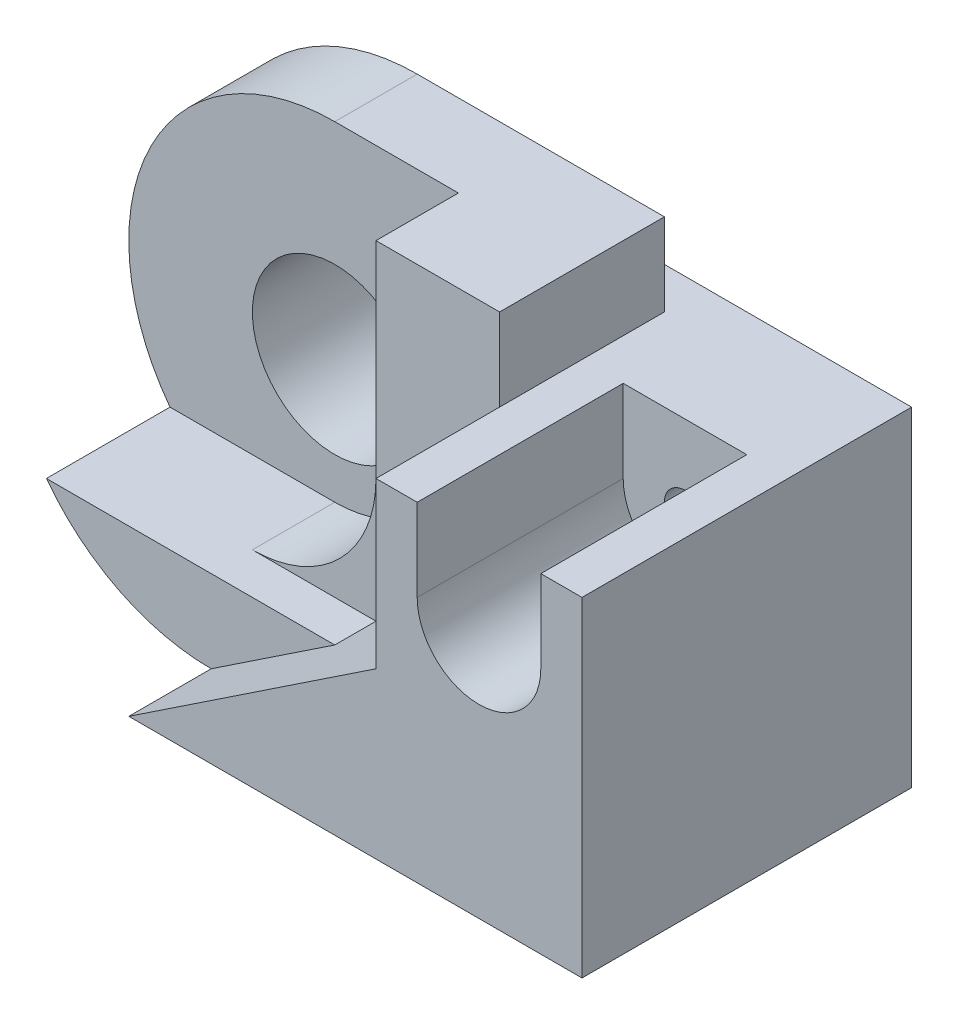
ISO-10303-21;
HEADER;
FILE_DESCRIPTION(('STEP AP214'),'2;1');
FILE_NAME('part.step','',(''),(''),'','','');
FILE_SCHEMA(('AUTOMOTIVE_DESIGN { 1 0 10303 214 1 1 1 1 }'));
ENDSEC;
DATA;
#1=APPLICATION_CONTEXT('core data for automotive mechanical design processes');
#2=APPLICATION_PROTOCOL_DEFINITION('international standard','automotive_design',2000,#1);
#3=PRODUCT_CONTEXT('',#1,'mechanical');
#4=PRODUCT('Part','Part','',(#3));
#5=PRODUCT_RELATED_PRODUCT_CATEGORY('part','',(#4));
#6=PRODUCT_DEFINITION_FORMATION('','',#4);
#7=PRODUCT_DEFINITION_CONTEXT('part definition',#1,'design');
#8=PRODUCT_DEFINITION('design','',#6,#7);
#9=PRODUCT_DEFINITION_SHAPE('','',#8);
#10=(LENGTH_UNIT() NAMED_UNIT(*) SI_UNIT(.MILLI.,.METRE.));
#11=(NAMED_UNIT(*) PLANE_ANGLE_UNIT() SI_UNIT($,.RADIAN.));
#12=(NAMED_UNIT(*) SI_UNIT($,.STERADIAN.) SOLID_ANGLE_UNIT());
#13=UNCERTAINTY_MEASURE_WITH_UNIT(LENGTH_MEASURE(1.E-05),#10,'distance_accuracy_value','');
#14=(GEOMETRIC_REPRESENTATION_CONTEXT(3) GLOBAL_UNCERTAINTY_ASSIGNED_CONTEXT((#13)) GLOBAL_UNIT_ASSIGNED_CONTEXT((#10,
#11,#12)) REPRESENTATION_CONTEXT('',''));
#15=CARTESIAN_POINT('',(0.,0.,0.));
#16=DIRECTION('',(0.,0.,1.));
#17=DIRECTION('',(1.,0.,0.));
#18=AXIS2_PLACEMENT_3D('',#15,#16,#17);
#19=CARTESIAN_POINT('',(0.,5.,3.));
#20=DIRECTION('',(0.,0.,1.));
#21=DIRECTION('',(1.,0.,0.));
#22=AXIS2_PLACEMENT_3D('',#19,#20,#21);
#23=PLANE('',#22);
#24=CARTESIAN_POINT('',(0.,5.,3.));
#25=DIRECTION('',(0.,0.,1.));
#26=DIRECTION('',(1.,0.,0.));
#27=AXIS2_PLACEMENT_3D('',#24,#25,#26);
#28=CIRCLE('',#27,2.);
#29=CARTESIAN_POINT('',(2.,5.,3.));
#30=VERTEX_POINT('',#29);
#31=EDGE_CURVE('E282',#30,#30,#28,.T.);
#32=ORIENTED_EDGE('',*,*,#31,.F.);
#33=EDGE_LOOP('',(#32));
#34=FACE_BOUND('',#33,.T.);
#35=CARTESIAN_POINT('',(0.,5.00000000000001,3.));
#36=DIRECTION('',(0.,0.,-1.));
#37=DIRECTION('',(-1.,0.,0.));
#38=AXIS2_PLACEMENT_3D('',#35,#36,#37);
#39=CIRCLE('',#38,3.00000000000001);
#40=CARTESIAN_POINT('',(3.,5.00000000000001,3.));
#41=VERTEX_POINT('',#40);
#42=CARTESIAN_POINT('',(0.,2.,3.));
#43=VERTEX_POINT('',#42);
#44=EDGE_CURVE('E50',#41,#43,#39,.T.);
#45=ORIENTED_EDGE('',*,*,#44,.F.);
#46=DIRECTION('',(0.,-1.,0.));
#47=VECTOR('',#46,1.);
#48=CARTESIAN_POINT('',(3.,10.,3.));
#49=LINE('',#48,#47);
#50=CARTESIAN_POINT('',(3.,10.,3.));
#51=VERTEX_POINT('',#50);
#52=EDGE_CURVE('E54',#51,#41,#49,.T.);
#53=ORIENTED_EDGE('',*,*,#52,.F.);
#54=DIRECTION('',(-1.,0.,0.));
#55=VECTOR('',#54,1.);
#56=CARTESIAN_POINT('',(6.,10.,3.));
#57=LINE('',#56,#55);
#58=CARTESIAN_POINT('',(0.,9.99999999999999,3.));
#59=VERTEX_POINT('',#58);
#60=EDGE_CURVE('E291',#51,#59,#57,.T.);
#61=ORIENTED_EDGE('',*,*,#60,.T.);
#62=CARTESIAN_POINT('',(0.,5.,3.));
#63=DIRECTION('',(0.,0.,1.));
#64=DIRECTION('',(1.,0.,0.));
#65=AXIS2_PLACEMENT_3D('',#62,#63,#64);
#66=CIRCLE('',#65,5.);
#67=CARTESIAN_POINT('',(-4.,2.,3.));
#68=VERTEX_POINT('',#67);
#69=EDGE_CURVE('E288',#59,#68,#66,.T.);
#70=ORIENTED_EDGE('',*,*,#69,.T.);
#71=DIRECTION('',(-1.,0.,0.));
#72=VECTOR('',#71,1.);
#73=CARTESIAN_POINT('',(3.,2.,3.));
#74=LINE('',#73,#72);
#75=EDGE_CURVE('E203',#43,#68,#74,.T.);
#76=ORIENTED_EDGE('',*,*,#75,.F.);
#77=EDGE_LOOP('',(#45,#53,#61,#70,#76));
#78=FACE_BOUND('',#77,.T.);
#79=ADVANCED_FACE('F35',(#34,#78),#23,.T.);
#80=CARTESIAN_POINT('',(0.,0.,8.));
#81=DIRECTION('',(0.554700196225229,-0.832050294337844,0.));
#82=DIRECTION('',(0.832050294337844,0.554700196225229,0.));
#83=AXIS2_PLACEMENT_3D('',#80,#81,#82);
#84=PLANE('',#83);
#85=DIRECTION('',(0.832050294337844,0.554700196225229,0.));
#86=VECTOR('',#85,1.);
#87=CARTESIAN_POINT('',(3.,2.,5.));
#88=LINE('',#87,#86);
#89=CARTESIAN_POINT('',(3.,2.,5.));
#90=VERTEX_POINT('',#89);
#91=CARTESIAN_POINT('',(6.,4.,5.));
#92=VERTEX_POINT('',#91);
#93=EDGE_CURVE('E187',#90,#92,#88,.T.);
#94=ORIENTED_EDGE('',*,*,#93,.F.);
#95=DIRECTION('',(0.,0.,-1.));
#96=VECTOR('',#95,1.);
#97=CARTESIAN_POINT('',(3.,2.,6.));
#98=LINE('',#97,#96);
#99=CARTESIAN_POINT('',(3.,2.,6.));
#100=VERTEX_POINT('',#99);
#101=EDGE_CURVE('E216',#100,#90,#98,.T.);
#102=ORIENTED_EDGE('',*,*,#101,.F.);
#103=DIRECTION('',(0.83205029433784,0.554700196225235,0.));
#104=VECTOR('',#103,1.);
#105=CARTESIAN_POINT('',(0.,0.,6.));
#106=LINE('',#105,#104);
#107=CARTESIAN_POINT('',(0.,0.,6.));
#108=VERTEX_POINT('',#107);
#109=EDGE_CURVE('E204',#108,#100,#106,.T.);
#110=ORIENTED_EDGE('',*,*,#109,.F.);
#111=DIRECTION('',(0.,0.,-1.));
#112=VECTOR('',#111,1.);
#113=CARTESIAN_POINT('',(0.,0.,8.));
#114=LINE('',#113,#112);
#115=CARTESIAN_POINT('',(0.,0.,8.));
#116=VERTEX_POINT('',#115);
#117=EDGE_CURVE('E261',#116,#108,#114,.T.);
#118=ORIENTED_EDGE('',*,*,#117,.F.);
#119=DIRECTION('',(-0.832050294337844,-0.554700196225229,0.));
#120=VECTOR('',#119,1.);
#121=CARTESIAN_POINT('',(0.,0.,8.));
#122=LINE('',#121,#120);
#123=CARTESIAN_POINT('',(6.,4.,8.));
#124=VERTEX_POINT('',#123);
#125=EDGE_CURVE('E253',#124,#116,#122,.T.);
#126=ORIENTED_EDGE('',*,*,#125,.F.);
#127=DIRECTION('',(0.,0.,-1.));
#128=VECTOR('',#127,1.);
#129=CARTESIAN_POINT('',(6.,4.,8.));
#130=LINE('',#129,#128);
#131=EDGE_CURVE('E264',#124,#92,#130,.T.);
#132=ORIENTED_EDGE('',*,*,#131,.T.);
#133=EDGE_LOOP('',(#94,#102,#110,#118,#126,#132));
#134=FACE_BOUND('',#133,.T.);
#135=ADVANCED_FACE('F330',(#134),#84,.F.);
#136=CARTESIAN_POINT('',(6.,4.,8.));
#137=DIRECTION('',(1.,0.,0.));
#138=DIRECTION('',(0.,0.,-1.));
#139=AXIS2_PLACEMENT_3D('',#136,#137,#138);
#140=PLANE('',#139);
#141=DIRECTION('',(0.,1.,0.));
#142=VECTOR('',#141,1.);
#143=CARTESIAN_POINT('',(6.,4.,5.));
#144=LINE('',#143,#142);
#145=CARTESIAN_POINT('',(6.,8.,5.));
#146=VERTEX_POINT('',#145);
#147=EDGE_CURVE('E191',#92,#146,#144,.T.);
#148=ORIENTED_EDGE('',*,*,#147,.F.);
#149=ORIENTED_EDGE('',*,*,#131,.F.);
#150=DIRECTION('',(0.,-1.,0.));
#151=VECTOR('',#150,1.);
#152=CARTESIAN_POINT('',(6.,4.,8.));
#153=LINE('',#152,#151);
#154=CARTESIAN_POINT('',(6.,8.,8.));
#155=VERTEX_POINT('',#154);
#156=EDGE_CURVE('E251',#155,#124,#153,.T.);
#157=ORIENTED_EDGE('',*,*,#156,.F.);
#158=DIRECTION('',(0.,0.,-1.));
#159=VECTOR('',#158,1.);
#160=CARTESIAN_POINT('',(6.,8.,8.));
#161=LINE('',#160,#159);
#162=EDGE_CURVE('E267',#155,#146,#161,.T.);
#163=ORIENTED_EDGE('',*,*,#162,.T.);
#164=EDGE_LOOP('',(#148,#149,#157,#163));
#165=FACE_BOUND('',#164,.T.);
#166=ADVANCED_FACE('F390',(#165),#140,.F.);
#167=CARTESIAN_POINT('',(0.,5.,0.));
#168=DIRECTION('',(0.,0.,1.));
#169=DIRECTION('',(1.,0.,0.));
#170=AXIS2_PLACEMENT_3D('',#167,#168,#169);
#171=PLANE('',#170);
#172=CARTESIAN_POINT('',(0.,5.,0.));
#173=DIRECTION('',(0.,0.,1.));
#174=DIRECTION('',(1.,0.,0.));
#175=AXIS2_PLACEMENT_3D('',#172,#173,#174);
#176=CIRCLE('',#175,5.);
#177=CARTESIAN_POINT('',(-4.,8.,0.));
#178=VERTEX_POINT('',#177);
#179=CARTESIAN_POINT('',(0.,0.,0.));
#180=VERTEX_POINT('',#179);
#181=EDGE_CURVE('E285',#178,#180,#176,.T.);
#182=ORIENTED_EDGE('',*,*,#181,.F.);
#183=DIRECTION('',(-1.,0.,0.));
#184=VECTOR('',#183,1.);
#185=CARTESIAN_POINT('',(11.,8.,0.));
#186=LINE('',#185,#184);
#187=CARTESIAN_POINT('',(11.,8.,0.));
#188=VERTEX_POINT('',#187);
#189=EDGE_CURVE('E292',#188,#178,#186,.T.);
#190=ORIENTED_EDGE('',*,*,#189,.F.);
#191=DIRECTION('',(0.,1.,0.));
#192=VECTOR('',#191,1.);
#193=CARTESIAN_POINT('',(11.,0.,0.));
#194=LINE('',#193,#192);
#195=CARTESIAN_POINT('',(11.,0.,0.));
#196=VERTEX_POINT('',#195);
#197=EDGE_CURVE('E298',#196,#188,#194,.T.);
#198=ORIENTED_EDGE('',*,*,#197,.F.);
#199=DIRECTION('',(1.,0.,0.));
#200=VECTOR('',#199,1.);
#201=CARTESIAN_POINT('',(0.,0.,0.));
#202=LINE('',#201,#200);
#203=EDGE_CURVE('E296',#180,#196,#202,.T.);
#204=ORIENTED_EDGE('',*,*,#203,.F.);
#205=EDGE_LOOP('',(#182,#190,#198,#204));
#206=FACE_BOUND('',#205,.T.);
#207=CARTESIAN_POINT('',(0.,5.,0.));
#208=DIRECTION('',(0.,0.,1.));
#209=DIRECTION('',(1.,0.,0.));
#210=AXIS2_PLACEMENT_3D('',#207,#208,#209);
#211=CIRCLE('',#210,2.);
#212=CARTESIAN_POINT('',(2.,5.,0.));
#213=VERTEX_POINT('',#212);
#214=EDGE_CURVE('E281',#213,#213,#211,.T.);
#215=ORIENTED_EDGE('',*,*,#214,.T.);
#216=EDGE_LOOP('',(#215));
#217=FACE_BOUND('',#216,.T.);
#218=ADVANCED_FACE('F351',(#206,#217),#171,.F.);
#219=CARTESIAN_POINT('',(0.,5.,3.));
#220=DIRECTION('',(0.,0.,-1.));
#221=DIRECTION('',(-1.,0.,0.));
#222=AXIS2_PLACEMENT_3D('',#219,#220,#221);
#223=CYLINDRICAL_SURFACE('',#222,5.);
#224=CARTESIAN_POINT('',(0.,5.,1.));
#225=DIRECTION('',(0.,0.,1.));
#226=DIRECTION('',(1.,0.,0.));
#227=AXIS2_PLACEMENT_3D('',#224,#225,#226);
#228=CIRCLE('',#227,5.);
#229=CARTESIAN_POINT('',(0.,9.99999999999999,1.));
#230=VERTEX_POINT('',#229);
#231=CARTESIAN_POINT('',(-4.,8.,1.));
#232=VERTEX_POINT('',#231);
#233=EDGE_CURVE('E275',#230,#232,#228,.T.);
#234=ORIENTED_EDGE('',*,*,#233,.T.);
#235=DIRECTION('',(0.,0.,-1.));
#236=VECTOR('',#235,1.);
#237=CARTESIAN_POINT('',(-4.,8.,3.));
#238=LINE('',#237,#236);
#239=EDGE_CURVE('E278',#232,#178,#238,.T.);
#240=ORIENTED_EDGE('',*,*,#239,.T.);
#241=ORIENTED_EDGE('',*,*,#181,.T.);
#242=DIRECTION('',(0.,0.,-1.));
#243=VECTOR('',#242,1.);
#244=CARTESIAN_POINT('',(0.,0.,3.));
#245=LINE('',#244,#243);
#246=EDGE_CURVE('E43',#108,#180,#245,.T.);
#247=ORIENTED_EDGE('',*,*,#246,.F.);
#248=CARTESIAN_POINT('',(0.,4.99999999999999,6.));
#249=DIRECTION('',(0.,0.,1.));
#250=DIRECTION('',(1.,0.,0.));
#251=AXIS2_PLACEMENT_3D('',#248,#249,#250);
#252=CIRCLE('',#251,4.99999999999998);
#253=CARTESIAN_POINT('',(-4.,2.,6.));
#254=VERTEX_POINT('',#253);
#255=EDGE_CURVE('E209',#254,#108,#252,.T.);
#256=ORIENTED_EDGE('',*,*,#255,.F.);
#257=DIRECTION('',(0.,0.,-1.));
#258=VECTOR('',#257,1.);
#259=CARTESIAN_POINT('',(-4.,2.,6.));
#260=LINE('',#259,#258);
#261=EDGE_CURVE('E212',#254,#68,#260,.T.);
#262=ORIENTED_EDGE('',*,*,#261,.T.);
#263=ORIENTED_EDGE('',*,*,#69,.F.);
#264=DIRECTION('',(0.,0.,-1.));
#265=VECTOR('',#264,1.);
#266=CARTESIAN_POINT('',(0.,9.99999999999999,3.));
#267=LINE('',#266,#265);
#268=EDGE_CURVE('E294',#59,#230,#267,.T.);
#269=ORIENTED_EDGE('',*,*,#268,.T.);
#270=EDGE_LOOP('',(#234,#240,#241,#247,#256,#262,#263,#269));
#271=FACE_BOUND('',#270,.T.);
#272=ADVANCED_FACE('F37',(#271),#223,.T.);
#273=CARTESIAN_POINT('',(0.,0.,3.));
#274=DIRECTION('',(0.,1.,0.));
#275=DIRECTION('',(0.,0.,1.));
#276=AXIS2_PLACEMENT_3D('',#273,#274,#275);
#277=PLANE('',#276);
#278=ORIENTED_EDGE('',*,*,#203,.T.);
#279=DIRECTION('',(0.,0.,-1.));
#280=VECTOR('',#279,1.);
#281=CARTESIAN_POINT('',(11.,0.,3.));
#282=LINE('',#281,#280);
#283=CARTESIAN_POINT('',(11.,0.,8.));
#284=VERTEX_POINT('',#283);
#285=EDGE_CURVE('E312',#284,#196,#282,.T.);
#286=ORIENTED_EDGE('',*,*,#285,.F.);
#287=DIRECTION('',(1.,0.,0.));
#288=VECTOR('',#287,1.);
#289=CARTESIAN_POINT('',(11.,0.,8.));
#290=LINE('',#289,#288);
#291=EDGE_CURVE('E255',#116,#284,#290,.T.);
#292=ORIENTED_EDGE('',*,*,#291,.F.);
#293=ORIENTED_EDGE('',*,*,#117,.T.);
#294=ORIENTED_EDGE('',*,*,#246,.T.);
#295=EDGE_LOOP('',(#278,#286,#292,#293,#294));
#296=FACE_BOUND('',#295,.T.);
#297=ADVANCED_FACE('F316',(#296),#277,.F.);
#298=CARTESIAN_POINT('',(11.,0.,3.));
#299=DIRECTION('',(-1.,0.,0.));
#300=DIRECTION('',(0.,0.,1.));
#301=AXIS2_PLACEMENT_3D('',#298,#299,#300);
#302=PLANE('',#301);
#303=ORIENTED_EDGE('',*,*,#197,.T.);
#304=DIRECTION('',(0.,0.,-1.));
#305=VECTOR('',#304,1.);
#306=CARTESIAN_POINT('',(11.,8.,3.));
#307=LINE('',#306,#305);
#308=CARTESIAN_POINT('',(11.,8.,8.));
#309=VERTEX_POINT('',#308);
#310=EDGE_CURVE('E309',#309,#188,#307,.T.);
#311=ORIENTED_EDGE('',*,*,#310,.F.);
#312=DIRECTION('',(0.,1.,0.));
#313=VECTOR('',#312,1.);
#314=CARTESIAN_POINT('',(11.,8.,8.));
#315=LINE('',#314,#313);
#316=EDGE_CURVE('E258',#284,#309,#315,.T.);
#317=ORIENTED_EDGE('',*,*,#316,.F.);
#318=ORIENTED_EDGE('',*,*,#285,.T.);
#319=EDGE_LOOP('',(#303,#311,#317,#318));
#320=FACE_BOUND('',#319,.T.);
#321=ADVANCED_FACE('F354',(#320),#302,.F.);
#322=CARTESIAN_POINT('',(11.,8.,3.));
#323=DIRECTION('',(0.,-1.,0.));
#324=DIRECTION('',(1.,0.,0.));
#325=AXIS2_PLACEMENT_3D('',#322,#323,#324);
#326=PLANE('',#325);
#327=DIRECTION('',(-1.,0.,0.));
#328=VECTOR('',#327,1.);
#329=CARTESIAN_POINT('',(7.,8.,3.));
#330=LINE('',#329,#328);
#331=CARTESIAN_POINT('',(10.,8.,3.));
#332=VERTEX_POINT('',#331);
#333=CARTESIAN_POINT('',(7.,8.,3.));
#334=VERTEX_POINT('',#333);
#335=EDGE_CURVE('E219',#332,#334,#330,.T.);
#336=ORIENTED_EDGE('',*,*,#335,.F.);
#337=DIRECTION('',(0.,0.,1.));
#338=VECTOR('',#337,1.);
#339=CARTESIAN_POINT('',(10.,8.,3.));
#340=LINE('',#339,#338);
#341=CARTESIAN_POINT('',(10.,8.,8.));
#342=VERTEX_POINT('',#341);
#343=EDGE_CURVE('E239',#332,#342,#340,.T.);
#344=ORIENTED_EDGE('',*,*,#343,.T.);
#345=DIRECTION('',(-1.,0.,0.));
#346=VECTOR('',#345,1.);
#347=CARTESIAN_POINT('',(6.,8.,8.));
#348=LINE('',#347,#346);
#349=EDGE_CURVE('E248',#309,#342,#348,.T.);
#350=ORIENTED_EDGE('',*,*,#349,.F.);
#351=ORIENTED_EDGE('',*,*,#310,.T.);
#352=ORIENTED_EDGE('',*,*,#189,.T.);
#353=ORIENTED_EDGE('',*,*,#239,.F.);
#354=DIRECTION('',(1.,0.,0.));
#355=VECTOR('',#354,1.);
#356=CARTESIAN_POINT('',(-9.,8.,1.));
#357=LINE('',#356,#355);
#358=CARTESIAN_POINT('',(6.,8.,1.));
#359=VERTEX_POINT('',#358);
#360=EDGE_CURVE('E273',#232,#359,#357,.T.);
#361=ORIENTED_EDGE('',*,*,#360,.T.);
#362=DIRECTION('',(0.,0.,-1.));
#363=VECTOR('',#362,1.);
#364=CARTESIAN_POINT('',(6.,8.,3.));
#365=LINE('',#364,#363);
#366=EDGE_CURVE('E306',#146,#359,#365,.T.);
#367=ORIENTED_EDGE('',*,*,#366,.F.);
#368=ORIENTED_EDGE('',*,*,#162,.F.);
#369=CARTESIAN_POINT('',(7.,8.,8.));
#370=VERTEX_POINT('',#369);
#371=EDGE_CURVE('E242',#370,#155,#348,.T.);
#372=ORIENTED_EDGE('',*,*,#371,.F.);
#373=DIRECTION('',(0.,0.,1.));
#374=VECTOR('',#373,1.);
#375=CARTESIAN_POINT('',(7.,8.,3.));
#376=LINE('',#375,#374);
#377=EDGE_CURVE('E232',#334,#370,#376,.T.);
#378=ORIENTED_EDGE('',*,*,#377,.F.);
#379=EDGE_LOOP('',(#336,#344,#350,#351,#352,#353,#361,#367,#368,#372,#378));
#380=FACE_BOUND('',#379,.T.);
#381=ADVANCED_FACE('F345',(#380),#326,.F.);
#382=CARTESIAN_POINT('',(6.,8.,3.));
#383=DIRECTION('',(-1.,0.,0.));
#384=DIRECTION('',(0.,0.,1.));
#385=AXIS2_PLACEMENT_3D('',#382,#383,#384);
#386=PLANE('',#385);
#387=ORIENTED_EDGE('',*,*,#366,.T.);
#388=DIRECTION('',(0.,-1.,0.));
#389=VECTOR('',#388,1.);
#390=CARTESIAN_POINT('',(6.,8.,1.));
#391=LINE('',#390,#389);
#392=CARTESIAN_POINT('',(6.,10.,1.));
#393=VERTEX_POINT('',#392);
#394=EDGE_CURVE('E270',#393,#359,#391,.T.);
#395=ORIENTED_EDGE('',*,*,#394,.F.);
#396=DIRECTION('',(0.,0.,-1.));
#397=VECTOR('',#396,1.);
#398=CARTESIAN_POINT('',(6.,10.,3.));
#399=LINE('',#398,#397);
#400=CARTESIAN_POINT('',(6.,10.,5.));
#401=VERTEX_POINT('',#400);
#402=EDGE_CURVE('E303',#401,#393,#399,.T.);
#403=ORIENTED_EDGE('',*,*,#402,.F.);
#404=EDGE_CURVE('E190',#146,#401,#144,.T.);
#405=ORIENTED_EDGE('',*,*,#404,.F.);
#406=EDGE_LOOP('',(#387,#395,#403,#405));
#407=FACE_BOUND('',#406,.T.);
#408=ADVANCED_FACE('F373',(#407),#386,.F.);
#409=CARTESIAN_POINT('',(6.,10.,3.));
#410=DIRECTION('',(0.,-1.,0.));
#411=DIRECTION('',(1.,0.,0.));
#412=AXIS2_PLACEMENT_3D('',#409,#410,#411);
#413=PLANE('',#412);
#414=ORIENTED_EDGE('',*,*,#402,.T.);
#415=DIRECTION('',(-1.,0.,0.));
#416=VECTOR('',#415,1.);
#417=CARTESIAN_POINT('',(6.,10.,1.));
#418=LINE('',#417,#416);
#419=EDGE_CURVE('E11',#393,#230,#418,.T.);
#420=ORIENTED_EDGE('',*,*,#419,.T.);
#421=ORIENTED_EDGE('',*,*,#268,.F.);
#422=ORIENTED_EDGE('',*,*,#60,.F.);
#423=DIRECTION('',(0.,0.,-1.));
#424=VECTOR('',#423,1.);
#425=CARTESIAN_POINT('',(3.,10.,5.));
#426=LINE('',#425,#424);
#427=CARTESIAN_POINT('',(3.,10.,5.));
#428=VERTEX_POINT('',#427);
#429=EDGE_CURVE('E200',#428,#51,#426,.T.);
#430=ORIENTED_EDGE('',*,*,#429,.F.);
#431=DIRECTION('',(-1.,0.,0.));
#432=VECTOR('',#431,1.);
#433=CARTESIAN_POINT('',(6.,10.,5.));
#434=LINE('',#433,#432);
#435=EDGE_CURVE('E176',#401,#428,#434,.T.);
#436=ORIENTED_EDGE('',*,*,#435,.F.);
#437=EDGE_LOOP('',(#414,#420,#421,#422,#430,#436));
#438=FACE_BOUND('',#437,.T.);
#439=ADVANCED_FACE('F338',(#438),#413,.F.);
#440=CARTESIAN_POINT('',(0.,5.,3.));
#441=DIRECTION('',(0.,0.,-1.));
#442=DIRECTION('',(-1.,0.,0.));
#443=AXIS2_PLACEMENT_3D('',#440,#441,#442);
#444=CYLINDRICAL_SURFACE('',#443,2.);
#445=ORIENTED_EDGE('',*,*,#31,.T.);
#446=EDGE_LOOP('',(#445));
#447=FACE_BOUND('',#446,.T.);
#448=ORIENTED_EDGE('',*,*,#214,.F.);
#449=EDGE_LOOP('',(#448));
#450=FACE_BOUND('',#449,.T.);
#451=ADVANCED_FACE('F380',(#447,#450),#444,.F.);
#452=CARTESIAN_POINT('',(-9.,8.,1.));
#453=DIRECTION('',(0.,0.,1.));
#454=DIRECTION('',(1.,0.,0.));
#455=AXIS2_PLACEMENT_3D('',#452,#453,#454);
#456=PLANE('',#455);
#457=ORIENTED_EDGE('',*,*,#419,.F.);
#458=ORIENTED_EDGE('',*,*,#394,.T.);
#459=ORIENTED_EDGE('',*,*,#360,.F.);
#460=ORIENTED_EDGE('',*,*,#233,.F.);
#461=EDGE_LOOP('',(#457,#458,#459,#460));
#462=FACE_BOUND('',#461,.T.);
#463=ADVANCED_FACE('F341',(#462),#456,.F.);
#464=CARTESIAN_POINT('',(0.,0.,8.));
#465=DIRECTION('',(0.,0.,-1.));
#466=DIRECTION('',(-1.,0.,0.));
#467=AXIS2_PLACEMENT_3D('',#464,#465,#466);
#468=PLANE('',#467);
#469=ORIENTED_EDGE('',*,*,#349,.T.);
#470=DIRECTION('',(0.,1.,0.));
#471=VECTOR('',#470,1.);
#472=CARTESIAN_POINT('',(10.,8.,8.));
#473=LINE('',#472,#471);
#474=CARTESIAN_POINT('',(10.,6.,8.));
#475=VERTEX_POINT('',#474);
#476=EDGE_CURVE('E223',#475,#342,#473,.T.);
#477=ORIENTED_EDGE('',*,*,#476,.F.);
#478=CARTESIAN_POINT('',(8.5,6.,8.));
#479=DIRECTION('',(0.,0.,1.));
#480=DIRECTION('',(-1.,0.,0.));
#481=AXIS2_PLACEMENT_3D('',#478,#479,#480);
#482=CIRCLE('',#481,1.5);
#483=CARTESIAN_POINT('',(7.,6.,8.));
#484=VERTEX_POINT('',#483);
#485=EDGE_CURVE('E235',#484,#475,#482,.T.);
#486=ORIENTED_EDGE('',*,*,#485,.F.);
#487=DIRECTION('',(0.,-1.,0.));
#488=VECTOR('',#487,1.);
#489=CARTESIAN_POINT('',(7.,8.,8.));
#490=LINE('',#489,#488);
#491=EDGE_CURVE('E218',#370,#484,#490,.T.);
#492=ORIENTED_EDGE('',*,*,#491,.F.);
#493=ORIENTED_EDGE('',*,*,#371,.T.);
#494=ORIENTED_EDGE('',*,*,#156,.T.);
#495=ORIENTED_EDGE('',*,*,#125,.T.);
#496=ORIENTED_EDGE('',*,*,#291,.T.);
#497=ORIENTED_EDGE('',*,*,#316,.T.);
#498=EDGE_LOOP('',(#469,#477,#486,#492,#493,#494,#495,#496,#497));
#499=FACE_BOUND('',#498,.T.);
#500=ADVANCED_FACE('F357',(#499),#468,.F.);
#501=CARTESIAN_POINT('',(10.,8.,3.));
#502=DIRECTION('',(1.,0.,0.));
#503=DIRECTION('',(0.,1.,0.));
#504=AXIS2_PLACEMENT_3D('',#501,#502,#503);
#505=PLANE('',#504);
#506=ORIENTED_EDGE('',*,*,#476,.T.);
#507=ORIENTED_EDGE('',*,*,#343,.F.);
#508=DIRECTION('',(0.,1.,0.));
#509=VECTOR('',#508,1.);
#510=CARTESIAN_POINT('',(10.,8.,3.));
#511=LINE('',#510,#509);
#512=CARTESIAN_POINT('',(10.,6.,3.));
#513=VERTEX_POINT('',#512);
#514=EDGE_CURVE('E229',#513,#332,#511,.T.);
#515=ORIENTED_EDGE('',*,*,#514,.F.);
#516=DIRECTION('',(0.,0.,1.));
#517=VECTOR('',#516,1.);
#518=CARTESIAN_POINT('',(10.,6.,3.));
#519=LINE('',#518,#517);
#520=EDGE_CURVE('E243',#513,#475,#519,.T.);
#521=ORIENTED_EDGE('',*,*,#520,.T.);
#522=EDGE_LOOP('',(#506,#507,#515,#521));
#523=FACE_BOUND('',#522,.T.);
#524=ADVANCED_FACE('F417',(#523),#505,.F.);
#525=CARTESIAN_POINT('',(8.5,6.,3.));
#526=DIRECTION('',(0.,0.,1.));
#527=DIRECTION('',(1.,0.,0.));
#528=AXIS2_PLACEMENT_3D('',#525,#526,#527);
#529=CYLINDRICAL_SURFACE('',#528,1.5);
#530=ORIENTED_EDGE('',*,*,#485,.T.);
#531=ORIENTED_EDGE('',*,*,#520,.F.);
#532=CARTESIAN_POINT('',(8.5,6.,3.));
#533=DIRECTION('',(0.,0.,1.));
#534=DIRECTION('',(-1.,0.,0.));
#535=AXIS2_PLACEMENT_3D('',#532,#533,#534);
#536=CIRCLE('',#535,1.5);
#537=CARTESIAN_POINT('',(7.,6.,3.));
#538=VERTEX_POINT('',#537);
#539=EDGE_CURVE('E226',#538,#513,#536,.T.);
#540=ORIENTED_EDGE('',*,*,#539,.F.);
#541=DIRECTION('',(0.,0.,1.));
#542=VECTOR('',#541,1.);
#543=CARTESIAN_POINT('',(7.,6.,3.));
#544=LINE('',#543,#542);
#545=EDGE_CURVE('E245',#538,#484,#544,.T.);
#546=ORIENTED_EDGE('',*,*,#545,.T.);
#547=EDGE_LOOP('',(#530,#531,#540,#546));
#548=FACE_BOUND('',#547,.T.);
#549=ADVANCED_FACE('F403',(#548),#529,.F.);
#550=CARTESIAN_POINT('',(7.,8.,3.));
#551=DIRECTION('',(-1.,0.,0.));
#552=DIRECTION('',(0.,0.,1.));
#553=AXIS2_PLACEMENT_3D('',#550,#551,#552);
#554=PLANE('',#553);
#555=ORIENTED_EDGE('',*,*,#491,.T.);
#556=ORIENTED_EDGE('',*,*,#545,.F.);
#557=DIRECTION('',(0.,-1.,0.));
#558=VECTOR('',#557,1.);
#559=CARTESIAN_POINT('',(7.,8.,3.));
#560=LINE('',#559,#558);
#561=EDGE_CURVE('E222',#334,#538,#560,.T.);
#562=ORIENTED_EDGE('',*,*,#561,.F.);
#563=ORIENTED_EDGE('',*,*,#377,.T.);
#564=EDGE_LOOP('',(#555,#556,#562,#563));
#565=FACE_BOUND('',#564,.T.);
#566=ADVANCED_FACE('F396',(#565),#554,.F.);
#567=CARTESIAN_POINT('',(8.5,6.,3.));
#568=DIRECTION('',(0.,0.,1.));
#569=DIRECTION('',(1.,0.,0.));
#570=AXIS2_PLACEMENT_3D('',#567,#568,#569);
#571=CIRCLE('',#570,0.49999999999999);
#572=CARTESIAN_POINT('',(8.99999999999999,6.,3.));
#573=VERTEX_POINT('',#572);
#574=EDGE_CURVE('E170',#573,#573,#571,.T.);
#575=ORIENTED_EDGE('',*,*,#574,.F.);
#576=EDGE_LOOP('',(#575));
#577=FACE_BOUND('',#576,.T.);
#578=ORIENTED_EDGE('',*,*,#335,.T.);
#579=ORIENTED_EDGE('',*,*,#561,.T.);
#580=ORIENTED_EDGE('',*,*,#539,.T.);
#581=ORIENTED_EDGE('',*,*,#514,.T.);
#582=EDGE_LOOP('',(#578,#579,#580,#581));
#583=FACE_BOUND('',#582,.T.);
#584=ADVANCED_FACE('F386',(#577,#583),#23,.T.);
#585=CARTESIAN_POINT('',(3.,2.,6.));
#586=DIRECTION('',(0.,-1.,0.));
#587=DIRECTION('',(1.,0.,0.));
#588=AXIS2_PLACEMENT_3D('',#585,#586,#587);
#589=PLANE('',#588);
#590=DIRECTION('',(1.,0.,0.));
#591=VECTOR('',#590,1.);
#592=CARTESIAN_POINT('',(0.,2.,5.));
#593=LINE('',#592,#591);
#594=CARTESIAN_POINT('',(0.,2.,5.));
#595=VERTEX_POINT('',#594);
#596=EDGE_CURVE('E184',#595,#90,#593,.T.);
#597=ORIENTED_EDGE('',*,*,#596,.F.);
#598=DIRECTION('',(0.,0.,-1.));
#599=VECTOR('',#598,1.);
#600=CARTESIAN_POINT('',(0.,2.,5.));
#601=LINE('',#600,#599);
#602=EDGE_CURVE('E193',#595,#43,#601,.T.);
#603=ORIENTED_EDGE('',*,*,#602,.T.);
#604=ORIENTED_EDGE('',*,*,#75,.T.);
#605=ORIENTED_EDGE('',*,*,#261,.F.);
#606=DIRECTION('',(-1.,0.,0.));
#607=VECTOR('',#606,1.);
#608=CARTESIAN_POINT('',(3.,2.,6.));
#609=LINE('',#608,#607);
#610=EDGE_CURVE('E207',#100,#254,#609,.T.);
#611=ORIENTED_EDGE('',*,*,#610,.F.);
#612=ORIENTED_EDGE('',*,*,#101,.T.);
#613=EDGE_LOOP('',(#597,#603,#604,#605,#611,#612));
#614=FACE_BOUND('',#613,.T.);
#615=ADVANCED_FACE('F333',(#614),#589,.F.);
#616=CARTESIAN_POINT('',(0.,4.99999999999999,6.));
#617=DIRECTION('',(0.,0.,1.));
#618=DIRECTION('',(1.,0.,0.));
#619=AXIS2_PLACEMENT_3D('',#616,#617,#618);
#620=PLANE('',#619);
#621=ORIENTED_EDGE('',*,*,#109,.T.);
#622=ORIENTED_EDGE('',*,*,#610,.T.);
#623=ORIENTED_EDGE('',*,*,#255,.T.);
#624=EDGE_LOOP('',(#621,#622,#623));
#625=FACE_BOUND('',#624,.T.);
#626=ADVANCED_FACE('F325',(#625),#620,.T.);
#627=CARTESIAN_POINT('',(3.,10.,5.));
#628=DIRECTION('',(1.,0.,0.));
#629=DIRECTION('',(0.,1.,0.));
#630=AXIS2_PLACEMENT_3D('',#627,#628,#629);
#631=PLANE('',#630);
#632=ORIENTED_EDGE('',*,*,#52,.T.);
#633=DIRECTION('',(0.,0.,-1.));
#634=VECTOR('',#633,1.);
#635=CARTESIAN_POINT('',(3.,5.,5.));
#636=LINE('',#635,#634);
#637=CARTESIAN_POINT('',(3.,5.,5.));
#638=VERTEX_POINT('',#637);
#639=EDGE_CURVE('E197',#638,#41,#636,.T.);
#640=ORIENTED_EDGE('',*,*,#639,.F.);
#641=DIRECTION('',(0.,-1.,0.));
#642=VECTOR('',#641,1.);
#643=CARTESIAN_POINT('',(3.,10.,5.));
#644=LINE('',#643,#642);
#645=EDGE_CURVE('E179',#428,#638,#644,.T.);
#646=ORIENTED_EDGE('',*,*,#645,.F.);
#647=ORIENTED_EDGE('',*,*,#429,.T.);
#648=EDGE_LOOP('',(#632,#640,#646,#647));
#649=FACE_BOUND('',#648,.T.);
#650=ADVANCED_FACE('F369',(#649),#631,.F.);
#651=CARTESIAN_POINT('',(0.,5.00000000000001,5.));
#652=DIRECTION('',(0.,0.,-1.));
#653=DIRECTION('',(-1.,0.,0.));
#654=AXIS2_PLACEMENT_3D('',#651,#652,#653);
#655=CYLINDRICAL_SURFACE('',#654,3.00000000000001);
#656=ORIENTED_EDGE('',*,*,#44,.T.);
#657=ORIENTED_EDGE('',*,*,#602,.F.);
#658=CARTESIAN_POINT('',(0.,5.00000000000001,5.));
#659=DIRECTION('',(0.,0.,-1.));
#660=DIRECTION('',(-1.,0.,0.));
#661=AXIS2_PLACEMENT_3D('',#658,#659,#660);
#662=CIRCLE('',#661,3.00000000000001);
#663=EDGE_CURVE('E181',#638,#595,#662,.T.);
#664=ORIENTED_EDGE('',*,*,#663,.F.);
#665=ORIENTED_EDGE('',*,*,#639,.T.);
#666=EDGE_LOOP('',(#656,#657,#664,#665));
#667=FACE_BOUND('',#666,.T.);
#668=ADVANCED_FACE('F367',(#667),#655,.F.);
#669=CARTESIAN_POINT('',(0.,5.00000000000001,5.));
#670=DIRECTION('',(0.,0.,-1.));
#671=DIRECTION('',(-1.,0.,0.));
#672=AXIS2_PLACEMENT_3D('',#669,#670,#671);
#673=PLANE('',#672);
#674=ORIENTED_EDGE('',*,*,#435,.T.);
#675=ORIENTED_EDGE('',*,*,#645,.T.);
#676=ORIENTED_EDGE('',*,*,#663,.T.);
#677=ORIENTED_EDGE('',*,*,#596,.T.);
#678=ORIENTED_EDGE('',*,*,#93,.T.);
#679=ORIENTED_EDGE('',*,*,#147,.T.);
#680=ORIENTED_EDGE('',*,*,#404,.T.);
#681=EDGE_LOOP('',(#674,#675,#676,#677,#678,#679,#680));
#682=FACE_BOUND('',#681,.T.);
#683=ADVANCED_FACE('F164',(#682),#673,.F.);
#684=CARTESIAN_POINT('',(8.5,6.,0.999999999999998));
#685=DIRECTION('',(0.,0.,1.));
#686=DIRECTION('',(1.,0.,0.));
#687=AXIS2_PLACEMENT_3D('',#684,#685,#686);
#688=CONICAL_SURFACE('',#687,0.499999999999997,1.02974425867665);
#689=CARTESIAN_POINT('',(8.5,6.,0.699569690486218));
#690=VERTEX_POINT('',#689);
#691=VERTEX_LOOP('',#690);
#692=FACE_BOUND('',#691,.T.);
#693=CARTESIAN_POINT('',(8.5,6.,0.999999999999998));
#694=DIRECTION('',(0.,0.,1.));
#695=DIRECTION('',(1.,0.,0.));
#696=AXIS2_PLACEMENT_3D('',#693,#694,#695);
#697=CIRCLE('',#696,0.499999999999997);
#698=CARTESIAN_POINT('',(9.,6.,0.999999999999998));
#699=VERTEX_POINT('',#698);
#700=EDGE_CURVE('E168',#699,#699,#697,.T.);
#701=ORIENTED_EDGE('',*,*,#700,.T.);
#702=EDGE_LOOP('',(#701));
#703=FACE_BOUND('',#702,.T.);
#704=ADVANCED_FACE('F160',(#692,#703),#688,.F.);
#705=CARTESIAN_POINT('',(8.5,6.,3.));
#706=DIRECTION('',(0.,0.,1.));
#707=DIRECTION('',(1.,0.,0.));
#708=AXIS2_PLACEMENT_3D('',#705,#706,#707);
#709=CYLINDRICAL_SURFACE('',#708,0.499999999999994);
#710=ORIENTED_EDGE('',*,*,#700,.F.);
#711=EDGE_LOOP('',(#710));
#712=FACE_BOUND('',#711,.T.);
#713=ORIENTED_EDGE('',*,*,#574,.T.);
#714=EDGE_LOOP('',(#713));
#715=FACE_BOUND('',#714,.T.);
#716=ADVANCED_FACE('F163',(#712,#715),#709,.F.);
#717=CLOSED_SHELL('',(#79,#135,#166,#218,#272,#297,#321,#381,#408,#439,#451,#463,#500,#524,#549,
#566,#584,#615,#626,#650,#668,#683,#704,#716));
#718=MANIFOLD_SOLID_BREP('B2',#717);
#719=ADVANCED_BREP_SHAPE_REPRESENTATION('',(#18,#718),#14);
#720=SHAPE_DEFINITION_REPRESENTATION(#9,#719);
ENDSEC;
END-ISO-10303-21;
